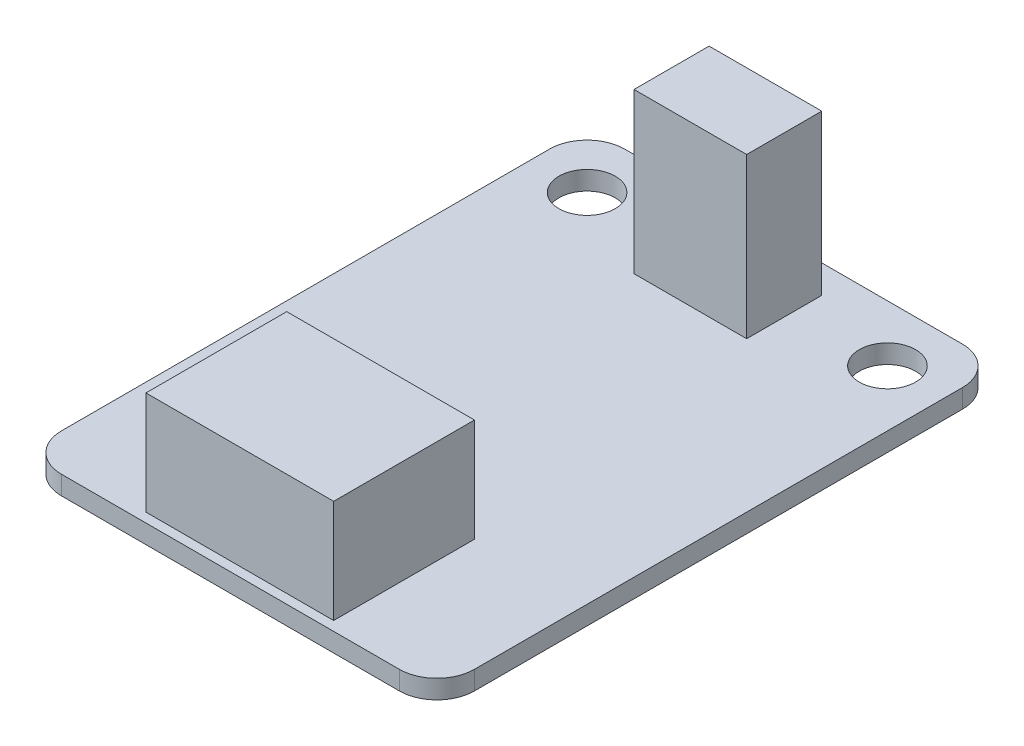
ISO-10303-21;
HEADER;
FILE_DESCRIPTION(('STEP AP214'),'2;1');
FILE_NAME('part.step','',(''),(''),'','','');
FILE_SCHEMA(('AUTOMOTIVE_DESIGN { 1 0 10303 214 1 1 1 1 }'));
ENDSEC;
DATA;
#1=APPLICATION_CONTEXT('core data for automotive mechanical design processes');
#2=APPLICATION_PROTOCOL_DEFINITION('international standard','automotive_design',2000,#1);
#3=PRODUCT_CONTEXT('',#1,'mechanical');
#4=PRODUCT('Part','Part','',(#3));
#5=PRODUCT_RELATED_PRODUCT_CATEGORY('part','',(#4));
#6=PRODUCT_DEFINITION_FORMATION('','',#4);
#7=PRODUCT_DEFINITION_CONTEXT('part definition',#1,'design');
#8=PRODUCT_DEFINITION('design','',#6,#7);
#9=PRODUCT_DEFINITION_SHAPE('','',#8);
#10=(LENGTH_UNIT() NAMED_UNIT(*) SI_UNIT(.MILLI.,.METRE.));
#11=(NAMED_UNIT(*) PLANE_ANGLE_UNIT() SI_UNIT($,.RADIAN.));
#12=(NAMED_UNIT(*) SI_UNIT($,.STERADIAN.) SOLID_ANGLE_UNIT());
#13=UNCERTAINTY_MEASURE_WITH_UNIT(LENGTH_MEASURE(1.E-05),#10,'distance_accuracy_value','');
#14=(GEOMETRIC_REPRESENTATION_CONTEXT(3) GLOBAL_UNCERTAINTY_ASSIGNED_CONTEXT((#13)) GLOBAL_UNIT_ASSIGNED_CONTEXT((#10,
#11,#12)) REPRESENTATION_CONTEXT('',''));
#15=CARTESIAN_POINT('',(0.,0.,0.));
#16=DIRECTION('',(0.,0.,1.));
#17=DIRECTION('',(1.,0.,0.));
#18=AXIS2_PLACEMENT_3D('',#15,#16,#17);
#19=CARTESIAN_POINT('',(2.,1.,-2.));
#20=DIRECTION('',(0.,-1.,0.));
#21=DIRECTION('',(0.,0.,-1.));
#22=AXIS2_PLACEMENT_3D('',#19,#20,#21);
#23=PLANE('',#22);
#24=DIRECTION('',(0.,0.,1.));
#25=VECTOR('',#24,1.);
#26=CARTESIAN_POINT('',(8.,1.,-28.5));
#27=LINE('',#26,#25);
#28=CARTESIAN_POINT('',(8.,1.,-28.5));
#29=VERTEX_POINT('',#28);
#30=CARTESIAN_POINT('',(8.,1.,-24.5));
#31=VERTEX_POINT('',#30);
#32=EDGE_CURVE('E182',#29,#31,#27,.T.);
#33=ORIENTED_EDGE('',*,*,#32,.F.);
#34=DIRECTION('',(-1.,0.,0.));
#35=VECTOR('',#34,1.);
#36=CARTESIAN_POINT('',(8.,1.,-28.5));
#37=LINE('',#36,#35);
#38=CARTESIAN_POINT('',(14.,1.,-28.5));
#39=VERTEX_POINT('',#38);
#40=EDGE_CURVE('E193',#39,#29,#37,.T.);
#41=ORIENTED_EDGE('',*,*,#40,.F.);
#42=DIRECTION('',(0.,0.,-1.));
#43=VECTOR('',#42,1.);
#44=CARTESIAN_POINT('',(14.,1.,-28.5));
#45=LINE('',#44,#43);
#46=CARTESIAN_POINT('',(14.,1.,-24.5));
#47=VERTEX_POINT('',#46);
#48=EDGE_CURVE('E210',#47,#39,#45,.T.);
#49=ORIENTED_EDGE('',*,*,#48,.F.);
#50=DIRECTION('',(1.,0.,0.));
#51=VECTOR('',#50,1.);
#52=CARTESIAN_POINT('',(8.,1.,-24.5));
#53=LINE('',#52,#51);
#54=EDGE_CURVE('E206',#31,#47,#53,.T.);
#55=ORIENTED_EDGE('',*,*,#54,.F.);
#56=EDGE_LOOP('',(#33,#41,#49,#55));
#57=FACE_BOUND('',#56,.T.);
#58=CARTESIAN_POINT('',(3.,1.,-27.));
#59=DIRECTION('',(0.,1.,0.));
#60=DIRECTION('',(0.,0.,1.));
#61=AXIS2_PLACEMENT_3D('',#58,#59,#60);
#62=CIRCLE('',#61,1.5);
#63=CARTESIAN_POINT('',(3.,1.,-25.5));
#64=VERTEX_POINT('',#63);
#65=EDGE_CURVE('E233',#64,#64,#62,.T.);
#66=ORIENTED_EDGE('',*,*,#65,.F.);
#67=EDGE_LOOP('',(#66));
#68=FACE_BOUND('',#67,.T.);
#69=CARTESIAN_POINT('',(19.,1.,-27.));
#70=DIRECTION('',(0.,1.,0.));
#71=DIRECTION('',(0.,0.,1.));
#72=AXIS2_PLACEMENT_3D('',#69,#70,#71);
#73=CIRCLE('',#72,1.5);
#74=CARTESIAN_POINT('',(19.,1.,-25.5));
#75=VERTEX_POINT('',#74);
#76=EDGE_CURVE('E232',#75,#75,#73,.T.);
#77=ORIENTED_EDGE('',*,*,#76,.F.);
#78=EDGE_LOOP('',(#77));
#79=FACE_BOUND('',#78,.T.);
#80=CARTESIAN_POINT('',(2.,1.,-2.));
#81=DIRECTION('',(0.,1.,0.));
#82=DIRECTION('',(0.,0.,-1.));
#83=AXIS2_PLACEMENT_3D('',#80,#81,#82);
#84=CIRCLE('',#83,2.);
#85=CARTESIAN_POINT('',(0.,1.,-2.00000000000001));
#86=VERTEX_POINT('',#85);
#87=CARTESIAN_POINT('',(2.00000000000001,1.,0.));
#88=VERTEX_POINT('',#87);
#89=EDGE_CURVE('E249',#86,#88,#84,.T.);
#90=ORIENTED_EDGE('',*,*,#89,.T.);
#91=DIRECTION('',(1.,0.,0.));
#92=VECTOR('',#91,1.);
#93=CARTESIAN_POINT('',(2.00000000000001,1.,0.));
#94=LINE('',#93,#92);
#95=CARTESIAN_POINT('',(20.,1.,0.));
#96=VERTEX_POINT('',#95);
#97=EDGE_CURVE('E253',#88,#96,#94,.T.);
#98=ORIENTED_EDGE('',*,*,#97,.T.);
#99=CARTESIAN_POINT('',(20.,1.,-2.));
#100=DIRECTION('',(0.,1.,0.));
#101=DIRECTION('',(0.,0.,1.));
#102=AXIS2_PLACEMENT_3D('',#99,#100,#101);
#103=CIRCLE('',#102,2.);
#104=CARTESIAN_POINT('',(22.,1.,-2.00000000000001));
#105=VERTEX_POINT('',#104);
#106=EDGE_CURVE('E257',#96,#105,#103,.T.);
#107=ORIENTED_EDGE('',*,*,#106,.T.);
#108=DIRECTION('',(0.,0.,-1.));
#109=VECTOR('',#108,1.);
#110=CARTESIAN_POINT('',(22.,1.,-2.00000000000001));
#111=LINE('',#110,#109);
#112=CARTESIAN_POINT('',(22.,1.,-28.));
#113=VERTEX_POINT('',#112);
#114=EDGE_CURVE('E260',#105,#113,#111,.T.);
#115=ORIENTED_EDGE('',*,*,#114,.T.);
#116=CARTESIAN_POINT('',(20.,1.,-28.));
#117=DIRECTION('',(0.,1.,0.));
#118=DIRECTION('',(0.,0.,-1.));
#119=AXIS2_PLACEMENT_3D('',#116,#117,#118);
#120=CIRCLE('',#119,2.);
#121=CARTESIAN_POINT('',(20.,1.,-30.));
#122=VERTEX_POINT('',#121);
#123=EDGE_CURVE('E263',#113,#122,#120,.T.);
#124=ORIENTED_EDGE('',*,*,#123,.T.);
#125=DIRECTION('',(-1.,0.,0.));
#126=VECTOR('',#125,1.);
#127=CARTESIAN_POINT('',(2.00000000000001,1.,-30.));
#128=LINE('',#127,#126);
#129=CARTESIAN_POINT('',(2.00000000000001,1.,-30.));
#130=VERTEX_POINT('',#129);
#131=EDGE_CURVE('E266',#122,#130,#128,.T.);
#132=ORIENTED_EDGE('',*,*,#131,.T.);
#133=CARTESIAN_POINT('',(2.,1.,-28.));
#134=DIRECTION('',(0.,1.,0.));
#135=DIRECTION('',(0.,0.,-1.));
#136=AXIS2_PLACEMENT_3D('',#133,#134,#135);
#137=CIRCLE('',#136,2.);
#138=CARTESIAN_POINT('',(0.,1.,-28.));
#139=VERTEX_POINT('',#138);
#140=EDGE_CURVE('E269',#130,#139,#137,.T.);
#141=ORIENTED_EDGE('',*,*,#140,.T.);
#142=DIRECTION('',(0.,0.,1.));
#143=VECTOR('',#142,1.);
#144=CARTESIAN_POINT('',(0.,1.,-2.00000000000001));
#145=LINE('',#144,#143);
#146=EDGE_CURVE('E272',#139,#86,#145,.T.);
#147=ORIENTED_EDGE('',*,*,#146,.T.);
#148=EDGE_LOOP('',(#90,#98,#107,#115,#124,#132,#141,#147));
#149=FACE_BOUND('',#148,.T.);
#150=DIRECTION('',(0.,0.,-1.));
#151=VECTOR('',#150,1.);
#152=CARTESIAN_POINT('',(16.,1.,-8.));
#153=LINE('',#152,#151);
#154=CARTESIAN_POINT('',(16.,1.,-0.499999999999999));
#155=VERTEX_POINT('',#154);
#156=CARTESIAN_POINT('',(16.,1.,-8.));
#157=VERTEX_POINT('',#156);
#158=EDGE_CURVE('E175',#155,#157,#153,.T.);
#159=ORIENTED_EDGE('',*,*,#158,.F.);
#160=DIRECTION('',(1.,0.,0.));
#161=VECTOR('',#160,1.);
#162=CARTESIAN_POINT('',(16.,1.,-0.499999999999999));
#163=LINE('',#162,#161);
#164=CARTESIAN_POINT('',(6.,1.,-0.499999999999999));
#165=VERTEX_POINT('',#164);
#166=EDGE_CURVE('E172',#165,#155,#163,.T.);
#167=ORIENTED_EDGE('',*,*,#166,.F.);
#168=DIRECTION('',(0.,0.,1.));
#169=VECTOR('',#168,1.);
#170=CARTESIAN_POINT('',(6.,1.,-8.));
#171=LINE('',#170,#169);
#172=CARTESIAN_POINT('',(6.,1.,-8.));
#173=VERTEX_POINT('',#172);
#174=EDGE_CURVE('E60',#173,#165,#171,.T.);
#175=ORIENTED_EDGE('',*,*,#174,.F.);
#176=DIRECTION('',(-1.,0.,0.));
#177=VECTOR('',#176,1.);
#178=CARTESIAN_POINT('',(16.,1.,-8.));
#179=LINE('',#178,#177);
#180=EDGE_CURVE('E55',#157,#173,#179,.T.);
#181=ORIENTED_EDGE('',*,*,#180,.F.);
#182=EDGE_LOOP('',(#159,#167,#175,#181));
#183=FACE_BOUND('',#182,.T.);
#184=ADVANCED_FACE('F39',(#57,#68,#79,#149,#183),#23,.F.);
#185=CARTESIAN_POINT('',(2.,1.,-2.));
#186=DIRECTION('',(0.,-1.,0.));
#187=DIRECTION('',(0.,0.,-1.));
#188=AXIS2_PLACEMENT_3D('',#185,#186,#187);
#189=CYLINDRICAL_SURFACE('',#188,2.);
#190=CARTESIAN_POINT('',(2.,0.,-2.));
#191=DIRECTION('',(0.,1.,0.));
#192=DIRECTION('',(0.,0.,-1.));
#193=AXIS2_PLACEMENT_3D('',#190,#191,#192);
#194=CIRCLE('',#193,2.);
#195=CARTESIAN_POINT('',(0.,0.,-2.00000000000001));
#196=VERTEX_POINT('',#195);
#197=CARTESIAN_POINT('',(2.00000000000001,0.,0.));
#198=VERTEX_POINT('',#197);
#199=EDGE_CURVE('E242',#196,#198,#194,.T.);
#200=ORIENTED_EDGE('',*,*,#199,.T.);
#201=DIRECTION('',(0.,-1.,0.));
#202=VECTOR('',#201,1.);
#203=CARTESIAN_POINT('',(2.00000000000001,1.,0.));
#204=LINE('',#203,#202);
#205=EDGE_CURVE('E11',#88,#198,#204,.T.);
#206=ORIENTED_EDGE('',*,*,#205,.F.);
#207=ORIENTED_EDGE('',*,*,#89,.F.);
#208=DIRECTION('',(0.,-1.,0.));
#209=VECTOR('',#208,1.);
#210=CARTESIAN_POINT('',(0.,1.,-2.00000000000001));
#211=LINE('',#210,#209);
#212=EDGE_CURVE('E275',#86,#196,#211,.T.);
#213=ORIENTED_EDGE('',*,*,#212,.T.);
#214=EDGE_LOOP('',(#200,#206,#207,#213));
#215=FACE_BOUND('',#214,.T.);
#216=ADVANCED_FACE('F41',(#215),#189,.T.);
#217=CARTESIAN_POINT('',(2.00000000000001,1.,0.));
#218=DIRECTION('',(0.,0.,-1.));
#219=DIRECTION('',(-1.,0.,0.));
#220=AXIS2_PLACEMENT_3D('',#217,#218,#219);
#221=PLANE('',#220);
#222=DIRECTION('',(1.,0.,0.));
#223=VECTOR('',#222,1.);
#224=CARTESIAN_POINT('',(2.00000000000001,0.,0.));
#225=LINE('',#224,#223);
#226=CARTESIAN_POINT('',(20.,0.,0.));
#227=VERTEX_POINT('',#226);
#228=EDGE_CURVE('E279',#198,#227,#225,.T.);
#229=ORIENTED_EDGE('',*,*,#228,.T.);
#230=DIRECTION('',(0.,-1.,0.));
#231=VECTOR('',#230,1.);
#232=CARTESIAN_POINT('',(20.,1.,0.));
#233=LINE('',#232,#231);
#234=EDGE_CURVE('E48',#96,#227,#233,.T.);
#235=ORIENTED_EDGE('',*,*,#234,.F.);
#236=ORIENTED_EDGE('',*,*,#97,.F.);
#237=ORIENTED_EDGE('',*,*,#205,.T.);
#238=EDGE_LOOP('',(#229,#235,#236,#237));
#239=FACE_BOUND('',#238,.T.);
#240=ADVANCED_FACE('F349',(#239),#221,.F.);
#241=CARTESIAN_POINT('',(20.,1.,-2.));
#242=DIRECTION('',(0.,-1.,0.));
#243=DIRECTION('',(0.,0.,-1.));
#244=AXIS2_PLACEMENT_3D('',#241,#242,#243);
#245=CYLINDRICAL_SURFACE('',#244,2.);
#246=CARTESIAN_POINT('',(20.,0.,-2.));
#247=DIRECTION('',(0.,1.,0.));
#248=DIRECTION('',(0.,0.,1.));
#249=AXIS2_PLACEMENT_3D('',#246,#247,#248);
#250=CIRCLE('',#249,2.);
#251=CARTESIAN_POINT('',(22.,0.,-2.00000000000001));
#252=VERTEX_POINT('',#251);
#253=EDGE_CURVE('E282',#227,#252,#250,.T.);
#254=ORIENTED_EDGE('',*,*,#253,.T.);
#255=DIRECTION('',(0.,-1.,0.));
#256=VECTOR('',#255,1.);
#257=CARTESIAN_POINT('',(22.,1.,-2.00000000000001));
#258=LINE('',#257,#256);
#259=EDGE_CURVE('E318',#105,#252,#258,.T.);
#260=ORIENTED_EDGE('',*,*,#259,.F.);
#261=ORIENTED_EDGE('',*,*,#106,.F.);
#262=ORIENTED_EDGE('',*,*,#234,.T.);
#263=EDGE_LOOP('',(#254,#260,#261,#262));
#264=FACE_BOUND('',#263,.T.);
#265=ADVANCED_FACE('F327',(#264),#245,.T.);
#266=CARTESIAN_POINT('',(22.,1.,-2.00000000000001));
#267=DIRECTION('',(-1.,0.,0.));
#268=DIRECTION('',(0.,0.,1.));
#269=AXIS2_PLACEMENT_3D('',#266,#267,#268);
#270=PLANE('',#269);
#271=DIRECTION('',(0.,0.,-1.));
#272=VECTOR('',#271,1.);
#273=CARTESIAN_POINT('',(22.,0.,-2.00000000000001));
#274=LINE('',#273,#272);
#275=CARTESIAN_POINT('',(22.,0.,-28.));
#276=VERTEX_POINT('',#275);
#277=EDGE_CURVE('E285',#252,#276,#274,.T.);
#278=ORIENTED_EDGE('',*,*,#277,.T.);
#279=DIRECTION('',(0.,-1.,0.));
#280=VECTOR('',#279,1.);
#281=CARTESIAN_POINT('',(22.,1.,-28.));
#282=LINE('',#281,#280);
#283=EDGE_CURVE('E314',#113,#276,#282,.T.);
#284=ORIENTED_EDGE('',*,*,#283,.F.);
#285=ORIENTED_EDGE('',*,*,#114,.F.);
#286=ORIENTED_EDGE('',*,*,#259,.T.);
#287=EDGE_LOOP('',(#278,#284,#285,#286));
#288=FACE_BOUND('',#287,.T.);
#289=ADVANCED_FACE('F338',(#288),#270,.F.);
#290=CARTESIAN_POINT('',(20.,1.,-28.));
#291=DIRECTION('',(0.,-1.,0.));
#292=DIRECTION('',(0.,0.,-1.));
#293=AXIS2_PLACEMENT_3D('',#290,#291,#292);
#294=CYLINDRICAL_SURFACE('',#293,2.);
#295=CARTESIAN_POINT('',(20.,0.,-28.));
#296=DIRECTION('',(0.,1.,0.));
#297=DIRECTION('',(0.,0.,-1.));
#298=AXIS2_PLACEMENT_3D('',#295,#296,#297);
#299=CIRCLE('',#298,2.);
#300=CARTESIAN_POINT('',(20.,0.,-30.));
#301=VERTEX_POINT('',#300);
#302=EDGE_CURVE('E288',#276,#301,#299,.T.);
#303=ORIENTED_EDGE('',*,*,#302,.T.);
#304=DIRECTION('',(0.,-1.,0.));
#305=VECTOR('',#304,1.);
#306=CARTESIAN_POINT('',(20.,1.,-30.));
#307=LINE('',#306,#305);
#308=EDGE_CURVE('E310',#122,#301,#307,.T.);
#309=ORIENTED_EDGE('',*,*,#308,.F.);
#310=ORIENTED_EDGE('',*,*,#123,.F.);
#311=ORIENTED_EDGE('',*,*,#283,.T.);
#312=EDGE_LOOP('',(#303,#309,#310,#311));
#313=FACE_BOUND('',#312,.T.);
#314=ADVANCED_FACE('F342',(#313),#294,.T.);
#315=CARTESIAN_POINT('',(2.00000000000001,1.,-30.));
#316=DIRECTION('',(0.,0.,1.));
#317=DIRECTION('',(1.,0.,0.));
#318=AXIS2_PLACEMENT_3D('',#315,#316,#317);
#319=PLANE('',#318);
#320=DIRECTION('',(-1.,0.,0.));
#321=VECTOR('',#320,1.);
#322=CARTESIAN_POINT('',(2.00000000000001,0.,-30.));
#323=LINE('',#322,#321);
#324=CARTESIAN_POINT('',(2.00000000000001,0.,-30.));
#325=VERTEX_POINT('',#324);
#326=EDGE_CURVE('E291',#301,#325,#323,.T.);
#327=ORIENTED_EDGE('',*,*,#326,.T.);
#328=DIRECTION('',(0.,-1.,0.));
#329=VECTOR('',#328,1.);
#330=CARTESIAN_POINT('',(2.00000000000001,1.,-30.));
#331=LINE('',#330,#329);
#332=EDGE_CURVE('E306',#130,#325,#331,.T.);
#333=ORIENTED_EDGE('',*,*,#332,.F.);
#334=ORIENTED_EDGE('',*,*,#131,.F.);
#335=ORIENTED_EDGE('',*,*,#308,.T.);
#336=EDGE_LOOP('',(#327,#333,#334,#335));
#337=FACE_BOUND('',#336,.T.);
#338=ADVANCED_FACE('F362',(#337),#319,.F.);
#339=CARTESIAN_POINT('',(2.,1.,-28.));
#340=DIRECTION('',(0.,-1.,0.));
#341=DIRECTION('',(0.,0.,-1.));
#342=AXIS2_PLACEMENT_3D('',#339,#340,#341);
#343=CYLINDRICAL_SURFACE('',#342,2.);
#344=CARTESIAN_POINT('',(2.,0.,-28.));
#345=DIRECTION('',(0.,1.,0.));
#346=DIRECTION('',(0.,0.,-1.));
#347=AXIS2_PLACEMENT_3D('',#344,#345,#346);
#348=CIRCLE('',#347,2.);
#349=CARTESIAN_POINT('',(0.,0.,-28.));
#350=VERTEX_POINT('',#349);
#351=EDGE_CURVE('E294',#325,#350,#348,.T.);
#352=ORIENTED_EDGE('',*,*,#351,.T.);
#353=DIRECTION('',(0.,-1.,0.));
#354=VECTOR('',#353,1.);
#355=CARTESIAN_POINT('',(0.,1.,-28.));
#356=LINE('',#355,#354);
#357=EDGE_CURVE('E302',#139,#350,#356,.T.);
#358=ORIENTED_EDGE('',*,*,#357,.F.);
#359=ORIENTED_EDGE('',*,*,#140,.F.);
#360=ORIENTED_EDGE('',*,*,#332,.T.);
#361=EDGE_LOOP('',(#352,#358,#359,#360));
#362=FACE_BOUND('',#361,.T.);
#363=ADVANCED_FACE('F360',(#362),#343,.T.);
#364=CARTESIAN_POINT('',(0.,1.,-2.00000000000001));
#365=DIRECTION('',(1.,0.,0.));
#366=DIRECTION('',(0.,0.,-1.));
#367=AXIS2_PLACEMENT_3D('',#364,#365,#366);
#368=PLANE('',#367);
#369=DIRECTION('',(0.,0.,1.));
#370=VECTOR('',#369,1.);
#371=CARTESIAN_POINT('',(0.,0.,-2.00000000000001));
#372=LINE('',#371,#370);
#373=EDGE_CURVE('E254',#350,#196,#372,.T.);
#374=ORIENTED_EDGE('',*,*,#373,.T.);
#375=ORIENTED_EDGE('',*,*,#212,.F.);
#376=ORIENTED_EDGE('',*,*,#146,.F.);
#377=ORIENTED_EDGE('',*,*,#357,.T.);
#378=EDGE_LOOP('',(#374,#375,#376,#377));
#379=FACE_BOUND('',#378,.T.);
#380=ADVANCED_FACE('F355',(#379),#368,.F.);
#381=CARTESIAN_POINT('',(2.,0.,-2.));
#382=DIRECTION('',(0.,-1.,0.));
#383=DIRECTION('',(0.,0.,-1.));
#384=AXIS2_PLACEMENT_3D('',#381,#382,#383);
#385=PLANE('',#384);
#386=CARTESIAN_POINT('',(3.,0.,-27.));
#387=DIRECTION('',(0.,-1.,0.));
#388=DIRECTION('',(0.,0.,-1.));
#389=AXIS2_PLACEMENT_3D('',#386,#387,#388);
#390=CIRCLE('',#389,1.5);
#391=CARTESIAN_POINT('',(3.,0.,-28.5));
#392=VERTEX_POINT('',#391);
#393=EDGE_CURVE('E237',#392,#392,#390,.F.);
#394=ORIENTED_EDGE('',*,*,#393,.T.);
#395=EDGE_LOOP('',(#394));
#396=FACE_BOUND('',#395,.T.);
#397=CARTESIAN_POINT('',(19.,0.,-27.));
#398=DIRECTION('',(0.,-1.,0.));
#399=DIRECTION('',(0.,0.,-1.));
#400=AXIS2_PLACEMENT_3D('',#397,#398,#399);
#401=CIRCLE('',#400,1.5);
#402=CARTESIAN_POINT('',(19.,0.,-28.5));
#403=VERTEX_POINT('',#402);
#404=EDGE_CURVE('E238',#403,#403,#401,.F.);
#405=ORIENTED_EDGE('',*,*,#404,.T.);
#406=EDGE_LOOP('',(#405));
#407=FACE_BOUND('',#406,.T.);
#408=ORIENTED_EDGE('',*,*,#199,.F.);
#409=ORIENTED_EDGE('',*,*,#373,.F.);
#410=ORIENTED_EDGE('',*,*,#351,.F.);
#411=ORIENTED_EDGE('',*,*,#326,.F.);
#412=ORIENTED_EDGE('',*,*,#302,.F.);
#413=ORIENTED_EDGE('',*,*,#277,.F.);
#414=ORIENTED_EDGE('',*,*,#253,.F.);
#415=ORIENTED_EDGE('',*,*,#228,.F.);
#416=EDGE_LOOP('',(#408,#409,#410,#411,#412,#413,#414,#415));
#417=FACE_BOUND('',#416,.T.);
#418=ADVANCED_FACE('F333',(#396,#407,#417),#385,.T.);
#419=CARTESIAN_POINT('',(19.,-4.24264068711929,-27.));
#420=DIRECTION('',(0.,1.,0.));
#421=DIRECTION('',(0.,0.,1.));
#422=AXIS2_PLACEMENT_3D('',#419,#420,#421);
#423=CYLINDRICAL_SURFACE('',#422,1.5);
#424=ORIENTED_EDGE('',*,*,#76,.T.);
#425=EDGE_LOOP('',(#424));
#426=FACE_BOUND('',#425,.T.);
#427=ORIENTED_EDGE('',*,*,#404,.F.);
#428=EDGE_LOOP('',(#427));
#429=FACE_BOUND('',#428,.T.);
#430=ADVANCED_FACE('F380',(#426,#429),#423,.F.);
#431=CARTESIAN_POINT('',(3.,-4.24264068711929,-27.));
#432=DIRECTION('',(0.,1.,0.));
#433=DIRECTION('',(0.,0.,1.));
#434=AXIS2_PLACEMENT_3D('',#431,#432,#433);
#435=CYLINDRICAL_SURFACE('',#434,1.5);
#436=ORIENTED_EDGE('',*,*,#65,.T.);
#437=EDGE_LOOP('',(#436));
#438=FACE_BOUND('',#437,.T.);
#439=ORIENTED_EDGE('',*,*,#393,.F.);
#440=EDGE_LOOP('',(#439));
#441=FACE_BOUND('',#440,.T.);
#442=ADVANCED_FACE('F400',(#438,#441),#435,.F.);
#443=CARTESIAN_POINT('',(8.,9.5,-28.5));
#444=DIRECTION('',(1.,0.,0.));
#445=DIRECTION('',(0.,0.,-1.));
#446=AXIS2_PLACEMENT_3D('',#443,#444,#445);
#447=PLANE('',#446);
#448=ORIENTED_EDGE('',*,*,#32,.T.);
#449=DIRECTION('',(0.,-1.,0.));
#450=VECTOR('',#449,1.);
#451=CARTESIAN_POINT('',(8.,9.5,-24.5));
#452=LINE('',#451,#450);
#453=CARTESIAN_POINT('',(8.,9.5,-24.5));
#454=VERTEX_POINT('',#453);
#455=EDGE_CURVE('E228',#454,#31,#452,.T.);
#456=ORIENTED_EDGE('',*,*,#455,.F.);
#457=DIRECTION('',(0.,0.,1.));
#458=VECTOR('',#457,1.);
#459=CARTESIAN_POINT('',(8.,9.5,-28.5));
#460=LINE('',#459,#458);
#461=CARTESIAN_POINT('',(8.,9.5,-28.5));
#462=VERTEX_POINT('',#461);
#463=EDGE_CURVE('E188',#462,#454,#460,.T.);
#464=ORIENTED_EDGE('',*,*,#463,.F.);
#465=DIRECTION('',(0.,-1.,0.));
#466=VECTOR('',#465,1.);
#467=CARTESIAN_POINT('',(8.,9.5,-28.5));
#468=LINE('',#467,#466);
#469=EDGE_CURVE('E202',#462,#29,#468,.T.);
#470=ORIENTED_EDGE('',*,*,#469,.T.);
#471=EDGE_LOOP('',(#448,#456,#464,#470));
#472=FACE_BOUND('',#471,.T.);
#473=ADVANCED_FACE('F407',(#472),#447,.F.);
#474=CARTESIAN_POINT('',(8.,9.5,-24.5));
#475=DIRECTION('',(0.,0.,-1.));
#476=DIRECTION('',(-1.,0.,0.));
#477=AXIS2_PLACEMENT_3D('',#474,#475,#476);
#478=PLANE('',#477);
#479=ORIENTED_EDGE('',*,*,#54,.T.);
#480=DIRECTION('',(0.,-1.,0.));
#481=VECTOR('',#480,1.);
#482=CARTESIAN_POINT('',(14.,9.5,-24.5));
#483=LINE('',#482,#481);
#484=CARTESIAN_POINT('',(14.,9.5,-24.5));
#485=VERTEX_POINT('',#484);
#486=EDGE_CURVE('E224',#485,#47,#483,.T.);
#487=ORIENTED_EDGE('',*,*,#486,.F.);
#488=DIRECTION('',(1.,0.,0.));
#489=VECTOR('',#488,1.);
#490=CARTESIAN_POINT('',(8.,9.5,-24.5));
#491=LINE('',#490,#489);
#492=EDGE_CURVE('E192',#454,#485,#491,.T.);
#493=ORIENTED_EDGE('',*,*,#492,.F.);
#494=ORIENTED_EDGE('',*,*,#455,.T.);
#495=EDGE_LOOP('',(#479,#487,#493,#494));
#496=FACE_BOUND('',#495,.T.);
#497=ADVANCED_FACE('F414',(#496),#478,.F.);
#498=CARTESIAN_POINT('',(14.,9.5,-28.5));
#499=DIRECTION('',(-1.,0.,0.));
#500=DIRECTION('',(0.,0.,1.));
#501=AXIS2_PLACEMENT_3D('',#498,#499,#500);
#502=PLANE('',#501);
#503=ORIENTED_EDGE('',*,*,#48,.T.);
#504=DIRECTION('',(0.,-1.,0.));
#505=VECTOR('',#504,1.);
#506=CARTESIAN_POINT('',(14.,9.5,-28.5));
#507=LINE('',#506,#505);
#508=CARTESIAN_POINT('',(14.,9.5,-28.5));
#509=VERTEX_POINT('',#508);
#510=EDGE_CURVE('E220',#509,#39,#507,.T.);
#511=ORIENTED_EDGE('',*,*,#510,.F.);
#512=DIRECTION('',(0.,0.,-1.));
#513=VECTOR('',#512,1.);
#514=CARTESIAN_POINT('',(14.,9.5,-28.5));
#515=LINE('',#514,#513);
#516=EDGE_CURVE('E196',#485,#509,#515,.T.);
#517=ORIENTED_EDGE('',*,*,#516,.F.);
#518=ORIENTED_EDGE('',*,*,#486,.T.);
#519=EDGE_LOOP('',(#503,#511,#517,#518));
#520=FACE_BOUND('',#519,.T.);
#521=ADVANCED_FACE('F422',(#520),#502,.F.);
#522=CARTESIAN_POINT('',(8.,9.5,-28.5));
#523=DIRECTION('',(0.,0.,1.));
#524=DIRECTION('',(1.,0.,0.));
#525=AXIS2_PLACEMENT_3D('',#522,#523,#524);
#526=PLANE('',#525);
#527=CARTESIAN_POINT('',(11.,6.5,-28.5));
#528=DIRECTION('',(0.,0.,1.));
#529=DIRECTION('',(1.,0.,0.));
#530=AXIS2_PLACEMENT_3D('',#527,#528,#529);
#531=CIRCLE('',#530,2.5);
#532=CARTESIAN_POINT('',(13.5,6.5,-28.5));
#533=VERTEX_POINT('',#532);
#534=EDGE_CURVE('E177',#533,#533,#531,.T.);
#535=ORIENTED_EDGE('',*,*,#534,.T.);
#536=EDGE_LOOP('',(#535));
#537=FACE_BOUND('',#536,.T.);
#538=ORIENTED_EDGE('',*,*,#40,.T.);
#539=ORIENTED_EDGE('',*,*,#469,.F.);
#540=DIRECTION('',(-1.,0.,0.));
#541=VECTOR('',#540,1.);
#542=CARTESIAN_POINT('',(8.,9.5,-28.5));
#543=LINE('',#542,#541);
#544=EDGE_CURVE('E199',#509,#462,#543,.T.);
#545=ORIENTED_EDGE('',*,*,#544,.F.);
#546=ORIENTED_EDGE('',*,*,#510,.T.);
#547=EDGE_LOOP('',(#538,#539,#545,#546));
#548=FACE_BOUND('',#547,.T.);
#549=ADVANCED_FACE('F430',(#537,#548),#526,.F.);
#550=CARTESIAN_POINT('',(0.,9.5,0.));
#551=DIRECTION('',(0.,1.,0.));
#552=DIRECTION('',(0.,0.,1.));
#553=AXIS2_PLACEMENT_3D('',#550,#551,#552);
#554=PLANE('',#553);
#555=ORIENTED_EDGE('',*,*,#463,.T.);
#556=ORIENTED_EDGE('',*,*,#492,.T.);
#557=ORIENTED_EDGE('',*,*,#516,.T.);
#558=ORIENTED_EDGE('',*,*,#544,.T.);
#559=EDGE_LOOP('',(#555,#556,#557,#558));
#560=FACE_BOUND('',#559,.T.);
#561=ADVANCED_FACE('F439',(#560),#554,.T.);
#562=CARTESIAN_POINT('',(11.,6.5,-27.1666666666667));
#563=DIRECTION('',(0.,0.,1.));
#564=DIRECTION('',(0.,-1.,0.));
#565=AXIS2_PLACEMENT_3D('',#562,#563,#564);
#566=SPHERICAL_SURFACE('',#565,2.83333333333333);
#567=ORIENTED_EDGE('',*,*,#534,.F.);
#568=EDGE_LOOP('',(#567));
#569=FACE_BOUND('',#568,.T.);
#570=ADVANCED_FACE('F447',(#569),#566,.T.);
#571=CARTESIAN_POINT('',(16.,6.5,-8.));
#572=DIRECTION('',(-1.,0.,0.));
#573=DIRECTION('',(0.,0.,1.));
#574=AXIS2_PLACEMENT_3D('',#571,#572,#573);
#575=PLANE('',#574);
#576=ORIENTED_EDGE('',*,*,#158,.T.);
#577=DIRECTION('',(0.,-1.,0.));
#578=VECTOR('',#577,1.);
#579=CARTESIAN_POINT('',(16.,6.5,-8.));
#580=LINE('',#579,#578);
#581=CARTESIAN_POINT('',(16.,6.5,-8.));
#582=VERTEX_POINT('',#581);
#583=EDGE_CURVE('E154',#582,#157,#580,.T.);
#584=ORIENTED_EDGE('',*,*,#583,.F.);
#585=DIRECTION('',(0.,0.,-1.));
#586=VECTOR('',#585,1.);
#587=CARTESIAN_POINT('',(16.,6.5,-8.));
#588=LINE('',#587,#586);
#589=CARTESIAN_POINT('',(16.,6.5,-0.499999999999999));
#590=VERTEX_POINT('',#589);
#591=EDGE_CURVE('E162',#590,#582,#588,.T.);
#592=ORIENTED_EDGE('',*,*,#591,.F.);
#593=DIRECTION('',(0.,-1.,0.));
#594=VECTOR('',#593,1.);
#595=CARTESIAN_POINT('',(16.,6.5,-0.499999999999999));
#596=LINE('',#595,#594);
#597=EDGE_CURVE('E570',#590,#155,#596,.T.);
#598=ORIENTED_EDGE('',*,*,#597,.T.);
#599=EDGE_LOOP('',(#576,#584,#592,#598));
#600=FACE_BOUND('',#599,.T.);
#601=ADVANCED_FACE('F174',(#600),#575,.F.);
#602=CARTESIAN_POINT('',(16.,6.5,-8.));
#603=DIRECTION('',(0.,0.,1.));
#604=DIRECTION('',(1.,0.,0.));
#605=AXIS2_PLACEMENT_3D('',#602,#603,#604);
#606=PLANE('',#605);
#607=ORIENTED_EDGE('',*,*,#180,.T.);
#608=DIRECTION('',(0.,-1.,0.));
#609=VECTOR('',#608,1.);
#610=CARTESIAN_POINT('',(6.,6.5,-8.));
#611=LINE('',#610,#609);
#612=CARTESIAN_POINT('',(6.,6.5,-8.));
#613=VERTEX_POINT('',#612);
#614=EDGE_CURVE('E157',#613,#173,#611,.T.);
#615=ORIENTED_EDGE('',*,*,#614,.F.);
#616=DIRECTION('',(-1.,0.,0.));
#617=VECTOR('',#616,1.);
#618=CARTESIAN_POINT('',(16.,6.5,-8.));
#619=LINE('',#618,#617);
#620=EDGE_CURVE('E150',#582,#613,#619,.T.);
#621=ORIENTED_EDGE('',*,*,#620,.F.);
#622=ORIENTED_EDGE('',*,*,#583,.T.);
#623=EDGE_LOOP('',(#607,#615,#621,#622));
#624=FACE_BOUND('',#623,.T.);
#625=ADVANCED_FACE('F152',(#624),#606,.F.);
#626=CARTESIAN_POINT('',(6.,6.5,-8.));
#627=DIRECTION('',(1.,0.,0.));
#628=DIRECTION('',(0.,0.,-1.));
#629=AXIS2_PLACEMENT_3D('',#626,#627,#628);
#630=PLANE('',#629);
#631=ORIENTED_EDGE('',*,*,#174,.T.);
#632=DIRECTION('',(0.,-1.,0.));
#633=VECTOR('',#632,1.);
#634=CARTESIAN_POINT('',(6.,6.5,-0.499999999999999));
#635=LINE('',#634,#633);
#636=CARTESIAN_POINT('',(6.,6.5,-0.499999999999999));
#637=VERTEX_POINT('',#636);
#638=EDGE_CURVE('E184',#637,#165,#635,.T.);
#639=ORIENTED_EDGE('',*,*,#638,.F.);
#640=DIRECTION('',(0.,0.,1.));
#641=VECTOR('',#640,1.);
#642=CARTESIAN_POINT('',(6.,6.5,-8.));
#643=LINE('',#642,#641);
#644=EDGE_CURVE('E161',#613,#637,#643,.T.);
#645=ORIENTED_EDGE('',*,*,#644,.F.);
#646=ORIENTED_EDGE('',*,*,#614,.T.);
#647=EDGE_LOOP('',(#631,#639,#645,#646));
#648=FACE_BOUND('',#647,.T.);
#649=ADVANCED_FACE('F467',(#648),#630,.F.);
#650=CARTESIAN_POINT('',(16.,6.5,-0.499999999999999));
#651=DIRECTION('',(0.,0.,-1.));
#652=DIRECTION('',(-1.,0.,0.));
#653=AXIS2_PLACEMENT_3D('',#650,#651,#652);
#654=PLANE('',#653);
#655=ORIENTED_EDGE('',*,*,#166,.T.);
#656=ORIENTED_EDGE('',*,*,#597,.F.);
#657=DIRECTION('',(1.,0.,0.));
#658=VECTOR('',#657,1.);
#659=CARTESIAN_POINT('',(16.,6.5,-0.499999999999999));
#660=LINE('',#659,#658);
#661=EDGE_CURVE('E167',#637,#590,#660,.T.);
#662=ORIENTED_EDGE('',*,*,#661,.F.);
#663=ORIENTED_EDGE('',*,*,#638,.T.);
#664=EDGE_LOOP('',(#655,#656,#662,#663));
#665=FACE_BOUND('',#664,.T.);
#666=ADVANCED_FACE('F474',(#665),#654,.F.);
#667=CARTESIAN_POINT('',(0.,6.5,0.));
#668=DIRECTION('',(0.,-1.,0.));
#669=DIRECTION('',(0.,0.,-1.));
#670=AXIS2_PLACEMENT_3D('',#667,#668,#669);
#671=PLANE('',#670);
#672=ORIENTED_EDGE('',*,*,#591,.T.);
#673=ORIENTED_EDGE('',*,*,#620,.T.);
#674=ORIENTED_EDGE('',*,*,#644,.T.);
#675=ORIENTED_EDGE('',*,*,#661,.T.);
#676=EDGE_LOOP('',(#672,#673,#674,#675));
#677=FACE_BOUND('',#676,.T.);
#678=ADVANCED_FACE('F165',(#677),#671,.F.);
#679=CLOSED_SHELL('',(#184,#216,#240,#265,#289,#314,#338,#363,#380,#418,#430,#442,#473,#497,
#521,#549,#561,#570,#601,#625,#649,#666,#678));
#680=MANIFOLD_SOLID_BREP('B2',#679);
#681=ADVANCED_BREP_SHAPE_REPRESENTATION('',(#18,#680),#14);
#682=SHAPE_DEFINITION_REPRESENTATION(#9,#681);
ENDSEC;
END-ISO-10303-21;
